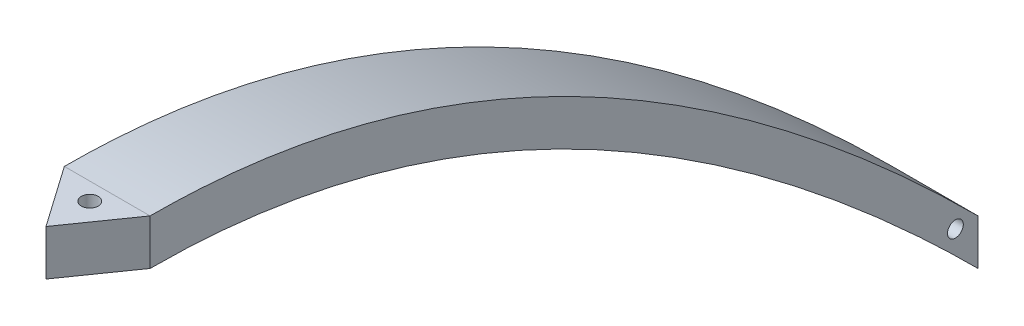
ISO-10303-21;
HEADER;
FILE_DESCRIPTION(('STEP AP214'),'2;1');
FILE_NAME('part.step','',(''),(''),'','','');
FILE_SCHEMA(('AUTOMOTIVE_DESIGN { 1 0 10303 214 1 1 1 1 }'));
ENDSEC;
DATA;
#1=APPLICATION_CONTEXT('core data for automotive mechanical design processes');
#2=APPLICATION_PROTOCOL_DEFINITION('international standard','automotive_design',2000,#1);
#3=PRODUCT_CONTEXT('',#1,'mechanical');
#4=PRODUCT('Part','Part','',(#3));
#5=PRODUCT_RELATED_PRODUCT_CATEGORY('part','',(#4));
#6=PRODUCT_DEFINITION_FORMATION('','',#4);
#7=PRODUCT_DEFINITION_CONTEXT('part definition',#1,'design');
#8=PRODUCT_DEFINITION('design','',#6,#7);
#9=PRODUCT_DEFINITION_SHAPE('','',#8);
#10=(LENGTH_UNIT() NAMED_UNIT(*) SI_UNIT(.MILLI.,.METRE.));
#11=(NAMED_UNIT(*) PLANE_ANGLE_UNIT() SI_UNIT($,.RADIAN.));
#12=(NAMED_UNIT(*) SI_UNIT($,.STERADIAN.) SOLID_ANGLE_UNIT());
#13=UNCERTAINTY_MEASURE_WITH_UNIT(LENGTH_MEASURE(1.E-05),#10,'distance_accuracy_value','');
#14=(GEOMETRIC_REPRESENTATION_CONTEXT(3) GLOBAL_UNCERTAINTY_ASSIGNED_CONTEXT((#13)) GLOBAL_UNIT_ASSIGNED_CONTEXT((#10,
#11,#12)) REPRESENTATION_CONTEXT('',''));
#15=CARTESIAN_POINT('',(0.,0.,0.));
#16=DIRECTION('',(0.,0.,1.));
#17=DIRECTION('',(1.,0.,0.));
#18=AXIS2_PLACEMENT_3D('',#15,#16,#17);
#19=CARTESIAN_POINT('',(10.52068,0.,0.));
#20=CARTESIAN_POINT('',(10.52068,1.98110171361183E-08,-50.7999999898115));
#21=CARTESIAN_POINT('',(10.52068,-50.7999999400009,-101.599999999434));
#22=B_SPLINE_CURVE_WITH_KNOTS('',2,(#19,#20,#21),.UNSPECIFIED.,.F.,.F.,(3,3),
(0.0847680360570745,0.932448396457804),.UNSPECIFIED.);
#23=DIRECTION('',(-1.,0.,0.));
#24=VECTOR('',#23,1.);
#25=SURFACE_OF_LINEAR_EXTRUSION('',#22,#24);
#26=CARTESIAN_POINT('',(0.,0.,0.));
#27=CARTESIAN_POINT('',(0.,1.98110171361183E-08,-50.7999999898115));
#28=CARTESIAN_POINT('',(0.,-50.7999999400009,-101.599999999434));
#29=B_SPLINE_CURVE_WITH_KNOTS('',2,(#26,#27,#28),.UNSPECIFIED.,.F.,.F.,(3,3),
(0.0847680360570745,0.932448396457804),.UNSPECIFIED.);
#30=CARTESIAN_POINT('',(0.,0.,0.));
#31=VERTEX_POINT('',#30);
#32=CARTESIAN_POINT('',(0.,-50.7999999405669,-101.6));
#33=VERTEX_POINT('',#32);
#34=EDGE_CURVE('E112',#31,#33,#29,.T.);
#35=ORIENTED_EDGE('',*,*,#34,.T.);
#36=DIRECTION('',(-1.,0.,0.));
#37=VECTOR('',#36,1.);
#38=CARTESIAN_POINT('',(10.52068,-50.7999999405669,-101.6));
#39=LINE('',#38,#37);
#40=CARTESIAN_POINT('',(10.52068,-50.7999999405669,-101.6));
#41=VERTEX_POINT('',#40);
#42=EDGE_CURVE('E11',#41,#33,#39,.T.);
#43=ORIENTED_EDGE('',*,*,#42,.F.);
#44=CARTESIAN_POINT('',(10.52068,0.,0.));
#45=VERTEX_POINT('',#44);
#46=EDGE_CURVE('E117',#45,#41,#22,.T.);
#47=ORIENTED_EDGE('',*,*,#46,.F.);
#48=DIRECTION('',(-1.,0.,0.));
#49=VECTOR('',#48,1.);
#50=CARTESIAN_POINT('',(10.52068,0.,0.));
#51=LINE('',#50,#49);
#52=EDGE_CURVE('E73',#45,#31,#51,.T.);
#53=ORIENTED_EDGE('',*,*,#52,.T.);
#54=EDGE_LOOP('',(#35,#43,#47,#53));
#55=FACE_BOUND('',#54,.T.);
#56=ADVANCED_FACE('F36',(#55),#25,.F.);
#57=CARTESIAN_POINT('',(10.52068,-50.7999999405669,-101.6));
#58=DIRECTION('',(0.,0.,1.));
#59=DIRECTION('',(1.,0.,0.));
#60=AXIS2_PLACEMENT_3D('',#57,#58,#59);
#61=PLANE('',#60);
#62=DIRECTION('',(0.,1.,0.));
#63=VECTOR('',#62,1.);
#64=CARTESIAN_POINT('',(0.,-50.7999999405669,-101.6));
#65=LINE('',#64,#63);
#66=CARTESIAN_POINT('',(0.,-45.2119999400009,-101.599999999434));
#67=VERTEX_POINT('',#66);
#68=EDGE_CURVE('E66',#33,#67,#65,.T.);
#69=ORIENTED_EDGE('',*,*,#68,.T.);
#70=DIRECTION('',(-1.,0.,0.));
#71=VECTOR('',#70,1.);
#72=CARTESIAN_POINT('',(10.52068,-45.2119999400009,-101.599999999434));
#73=LINE('',#72,#71);
#74=CARTESIAN_POINT('',(10.52068,-45.2119999400009,-101.599999999434));
#75=VERTEX_POINT('',#74);
#76=EDGE_CURVE('E45',#75,#67,#73,.T.);
#77=ORIENTED_EDGE('',*,*,#76,.F.);
#78=DIRECTION('',(0.,1.,0.));
#79=VECTOR('',#78,1.);
#80=CARTESIAN_POINT('',(10.52068,-50.7999999405669,-101.6));
#81=LINE('',#80,#79);
#82=EDGE_CURVE('E78',#41,#75,#81,.T.);
#83=ORIENTED_EDGE('',*,*,#82,.F.);
#84=ORIENTED_EDGE('',*,*,#42,.T.);
#85=EDGE_LOOP('',(#69,#77,#83,#84));
#86=FACE_BOUND('',#85,.T.);
#87=ADVANCED_FACE('F140',(#86),#61,.F.);
#88=CARTESIAN_POINT('',(10.52068,-45.2119999400009,-101.599999999434));
#89=CARTESIAN_POINT('',(10.52068,5.58800002320726,-50.7999999909436));
#90=CARTESIAN_POINT('',(10.52068,5.5880000045283,0.));
#91=B_SPLINE_CURVE_WITH_KNOTS('',2,(#88,#89,#90),.UNSPECIFIED.,.F.,.F.,(3,3),
(0.0847680360381841,0.932448396457804),.UNSPECIFIED.);
#92=DIRECTION('',(-1.,0.,0.));
#93=VECTOR('',#92,1.);
#94=SURFACE_OF_LINEAR_EXTRUSION('',#91,#93);
#95=CARTESIAN_POINT('',(0.,-45.2119999400009,-101.599999999434));
#96=CARTESIAN_POINT('',(0.,5.58800002320726,-50.7999999909436));
#97=CARTESIAN_POINT('',(0.,5.5880000045283,0.));
#98=B_SPLINE_CURVE_WITH_KNOTS('',2,(#95,#96,#97),.UNSPECIFIED.,.F.,.F.,(3,3),
(0.0847680360381841,0.932448396457804),.UNSPECIFIED.);
#99=CARTESIAN_POINT('',(0.,5.58800000452828,0.));
#100=VERTEX_POINT('',#99);
#101=EDGE_CURVE('E154',#67,#100,#98,.T.);
#102=ORIENTED_EDGE('',*,*,#101,.T.);
#103=DIRECTION('',(-1.,0.,0.));
#104=VECTOR('',#103,1.);
#105=CARTESIAN_POINT('',(10.52068,5.58800000452828,0.));
#106=LINE('',#105,#104);
#107=CARTESIAN_POINT('',(10.52068,5.58800000452828,0.));
#108=VERTEX_POINT('',#107);
#109=EDGE_CURVE('E104',#108,#100,#106,.T.);
#110=ORIENTED_EDGE('',*,*,#109,.F.);
#111=EDGE_CURVE('E127',#75,#108,#91,.T.);
#112=ORIENTED_EDGE('',*,*,#111,.F.);
#113=ORIENTED_EDGE('',*,*,#76,.T.);
#114=EDGE_LOOP('',(#102,#110,#112,#113));
#115=FACE_BOUND('',#114,.T.);
#116=ADVANCED_FACE('F136',(#115),#94,.F.);
#117=CARTESIAN_POINT('',(10.52068,-12.6999999750947,-50.7999999947642));
#118=DIRECTION('',(1.,0.,0.));
#119=DIRECTION('',(0.,0.,-1.));
#120=AXIS2_PLACEMENT_3D('',#117,#118,#119);
#121=PLANE('',#120);
#122=CARTESIAN_POINT('',(10.52068,-45.2119999400269,-98.8259977455377));
#123=DIRECTION('',(1.,0.,0.));
#124=DIRECTION('',(0.,0.,-1.));
#125=AXIS2_PLACEMENT_3D('',#122,#123,#124);
#126=CIRCLE('',#125,0.970454713229181);
#127=CARTESIAN_POINT('',(10.52068,-45.2119999400269,-99.7964524587669));
#128=VERTEX_POINT('',#127);
#129=EDGE_CURVE('E165',#128,#128,#126,.F.);
#130=ORIENTED_EDGE('',*,*,#129,.T.);
#131=EDGE_LOOP('',(#130));
#132=FACE_BOUND('',#131,.T.);
#133=ORIENTED_EDGE('',*,*,#46,.T.);
#134=ORIENTED_EDGE('',*,*,#82,.T.);
#135=ORIENTED_EDGE('',*,*,#111,.T.);
#136=DIRECTION('',(0.,-1.,0.));
#137=VECTOR('',#136,1.);
#138=CARTESIAN_POINT('',(10.52068,0.,0.));
#139=LINE('',#138,#137);
#140=EDGE_CURVE('E53',#108,#45,#139,.T.);
#141=ORIENTED_EDGE('',*,*,#140,.T.);
#142=EDGE_LOOP('',(#133,#134,#135,#141));
#143=FACE_BOUND('',#142,.T.);
#144=ADVANCED_FACE('F139',(#132,#143),#121,.T.);
#145=CARTESIAN_POINT('',(0.,-12.6999999750947,-50.7999999947642));
#146=DIRECTION('',(1.,0.,0.));
#147=DIRECTION('',(0.,0.,-1.));
#148=AXIS2_PLACEMENT_3D('',#145,#146,#147);
#149=PLANE('',#148);
#150=CARTESIAN_POINT('',(0.,-45.2119999400269,-98.8259977455377));
#151=DIRECTION('',(-1.,0.,0.));
#152=DIRECTION('',(0.,0.,1.));
#153=AXIS2_PLACEMENT_3D('',#150,#151,#152);
#154=CIRCLE('',#153,0.970454713229181);
#155=CARTESIAN_POINT('',(0.,-45.2119999400269,-97.8555430323086));
#156=VERTEX_POINT('',#155);
#157=EDGE_CURVE('E168',#156,#156,#154,.T.);
#158=ORIENTED_EDGE('',*,*,#157,.F.);
#159=EDGE_LOOP('',(#158));
#160=FACE_BOUND('',#159,.T.);
#161=ORIENTED_EDGE('',*,*,#34,.F.);
#162=DIRECTION('',(0.,-1.,0.));
#163=VECTOR('',#162,1.);
#164=CARTESIAN_POINT('',(0.,0.,0.));
#165=LINE('',#164,#163);
#166=EDGE_CURVE('E122',#100,#31,#165,.T.);
#167=ORIENTED_EDGE('',*,*,#166,.F.);
#168=ORIENTED_EDGE('',*,*,#101,.F.);
#169=ORIENTED_EDGE('',*,*,#68,.F.);
#170=EDGE_LOOP('',(#161,#167,#168,#169));
#171=FACE_BOUND('',#170,.T.);
#172=ADVANCED_FACE('F142',(#160,#171),#149,.F.);
#173=CARTESIAN_POINT('',(5.26034,5.58800000452828,7.51254408578574));
#174=DIRECTION('',(0.819152044288989,0.,-0.57357643635105));
#175=DIRECTION('',(-0.57357643635105,0.,-0.819152044288989));
#176=AXIS2_PLACEMENT_3D('',#173,#174,#175);
#177=PLANE('',#176);
#178=DIRECTION('',(0.57357643635105,0.,0.819152044288989));
#179=VECTOR('',#178,1.);
#180=CARTESIAN_POINT('',(5.26034,0.,7.51254408578574));
#181=LINE('',#180,#179);
#182=CARTESIAN_POINT('',(5.26034,0.,7.51254408578574));
#183=VERTEX_POINT('',#182);
#184=EDGE_CURVE('E111',#31,#183,#181,.T.);
#185=ORIENTED_EDGE('',*,*,#184,.T.);
#186=DIRECTION('',(0.,-1.,0.));
#187=VECTOR('',#186,1.);
#188=CARTESIAN_POINT('',(5.26034,5.58800000452828,7.51254408578574));
#189=LINE('',#188,#187);
#190=CARTESIAN_POINT('',(5.26034,5.58800000452828,7.51254408578574));
#191=VERTEX_POINT('',#190);
#192=EDGE_CURVE('E95',#191,#183,#189,.T.);
#193=ORIENTED_EDGE('',*,*,#192,.F.);
#194=DIRECTION('',(0.57357643635105,0.,0.819152044288989));
#195=VECTOR('',#194,1.);
#196=CARTESIAN_POINT('',(5.26034,5.58800000452828,7.51254408578574));
#197=LINE('',#196,#195);
#198=EDGE_CURVE('E99',#100,#191,#197,.T.);
#199=ORIENTED_EDGE('',*,*,#198,.F.);
#200=ORIENTED_EDGE('',*,*,#166,.T.);
#201=EDGE_LOOP('',(#185,#193,#199,#200));
#202=FACE_BOUND('',#201,.T.);
#203=ADVANCED_FACE('F109',(#202),#177,.F.);
#204=CARTESIAN_POINT('',(10.52068,5.58800000452828,0.));
#205=DIRECTION('',(-0.819152044288989,0.,-0.57357643635105));
#206=DIRECTION('',(-0.57357643635105,0.,0.819152044288989));
#207=AXIS2_PLACEMENT_3D('',#204,#205,#206);
#208=PLANE('',#207);
#209=DIRECTION('',(0.57357643635105,0.,-0.819152044288989));
#210=VECTOR('',#209,1.);
#211=CARTESIAN_POINT('',(10.52068,0.,0.));
#212=LINE('',#211,#210);
#213=EDGE_CURVE('E107',#183,#45,#212,.T.);
#214=ORIENTED_EDGE('',*,*,#213,.T.);
#215=ORIENTED_EDGE('',*,*,#140,.F.);
#216=DIRECTION('',(0.57357643635105,0.,-0.819152044288989));
#217=VECTOR('',#216,1.);
#218=CARTESIAN_POINT('',(10.52068,5.58800000452828,0.));
#219=LINE('',#218,#217);
#220=EDGE_CURVE('E90',#191,#108,#219,.T.);
#221=ORIENTED_EDGE('',*,*,#220,.F.);
#222=ORIENTED_EDGE('',*,*,#192,.T.);
#223=EDGE_LOOP('',(#214,#215,#221,#222));
#224=FACE_BOUND('',#223,.T.);
#225=ADVANCED_FACE('F93',(#224),#208,.F.);
#226=CARTESIAN_POINT('',(0.,5.58800000452828,0.));
#227=DIRECTION('',(0.,1.,0.));
#228=DIRECTION('',(0.,0.,1.));
#229=AXIS2_PLACEMENT_3D('',#226,#227,#228);
#230=PLANE('',#229);
#231=CARTESIAN_POINT('',(5.26034,5.58800000452828,2.13725197517794));
#232=DIRECTION('',(0.,1.,0.));
#233=DIRECTION('',(0.,0.,1.));
#234=AXIS2_PLACEMENT_3D('',#231,#232,#233);
#235=CIRCLE('',#234,1.0371132558962);
#236=CARTESIAN_POINT('',(5.26034,5.58800000452828,3.17436523107414));
#237=VERTEX_POINT('',#236);
#238=EDGE_CURVE('E160',#237,#237,#235,.T.);
#239=ORIENTED_EDGE('',*,*,#238,.F.);
#240=EDGE_LOOP('',(#239));
#241=FACE_BOUND('',#240,.T.);
#242=ORIENTED_EDGE('',*,*,#198,.T.);
#243=ORIENTED_EDGE('',*,*,#220,.T.);
#244=ORIENTED_EDGE('',*,*,#109,.T.);
#245=EDGE_LOOP('',(#242,#243,#244));
#246=FACE_BOUND('',#245,.T.);
#247=ADVANCED_FACE('F102',(#241,#246),#230,.T.);
#248=CARTESIAN_POINT('',(0.,0.,0.));
#249=DIRECTION('',(0.,1.,0.));
#250=DIRECTION('',(0.,0.,1.));
#251=AXIS2_PLACEMENT_3D('',#248,#249,#250);
#252=PLANE('',#251);
#253=CARTESIAN_POINT('',(5.26034,0.,2.13725197517794));
#254=DIRECTION('',(0.,1.,0.));
#255=DIRECTION('',(0.,0.,1.));
#256=AXIS2_PLACEMENT_3D('',#253,#254,#255);
#257=CIRCLE('',#256,1.0371132558962);
#258=CARTESIAN_POINT('',(5.26034,0.,3.17436523107414));
#259=VERTEX_POINT('',#258);
#260=EDGE_CURVE('E158',#259,#259,#257,.F.);
#261=ORIENTED_EDGE('',*,*,#260,.F.);
#262=EDGE_LOOP('',(#261));
#263=FACE_BOUND('',#262,.T.);
#264=ORIENTED_EDGE('',*,*,#184,.F.);
#265=ORIENTED_EDGE('',*,*,#52,.F.);
#266=ORIENTED_EDGE('',*,*,#213,.F.);
#267=EDGE_LOOP('',(#264,#265,#266));
#268=FACE_BOUND('',#267,.T.);
#269=ADVANCED_FACE('F157',(#263,#268),#252,.F.);
#270=CARTESIAN_POINT('',(5.26034,-2.93339926441065,2.13725197517794));
#271=DIRECTION('',(0.,1.,0.));
#272=DIRECTION('',(0.,0.,1.));
#273=AXIS2_PLACEMENT_3D('',#270,#271,#272);
#274=CYLINDRICAL_SURFACE('',#273,1.0371132558962);
#275=ORIENTED_EDGE('',*,*,#260,.T.);
#276=EDGE_LOOP('',(#275));
#277=FACE_BOUND('',#276,.T.);
#278=ORIENTED_EDGE('',*,*,#238,.T.);
#279=EDGE_LOOP('',(#278));
#280=FACE_BOUND('',#279,.T.);
#281=ADVANCED_FACE('F189',(#277,#280),#274,.F.);
#282=CARTESIAN_POINT('',(13.2655404342352,-45.2119999400269,-98.8259977455377));
#283=DIRECTION('',(-1.,0.,0.));
#284=DIRECTION('',(0.,0.,1.));
#285=AXIS2_PLACEMENT_3D('',#282,#283,#284);
#286=CYLINDRICAL_SURFACE('',#285,0.970454713229181);
#287=ORIENTED_EDGE('',*,*,#157,.T.);
#288=EDGE_LOOP('',(#287));
#289=FACE_BOUND('',#288,.T.);
#290=ORIENTED_EDGE('',*,*,#129,.F.);
#291=EDGE_LOOP('',(#290));
#292=FACE_BOUND('',#291,.T.);
#293=ADVANCED_FACE('F172',(#289,#292),#286,.F.);
#294=CLOSED_SHELL('',(#56,#87,#116,#144,#172,#203,#225,#247,#269,#281,#293));
#295=MANIFOLD_SOLID_BREP('B2',#294);
#296=ADVANCED_BREP_SHAPE_REPRESENTATION('',(#18,#295),#14);
#297=SHAPE_DEFINITION_REPRESENTATION(#9,#296);
ENDSEC;
END-ISO-10303-21;
